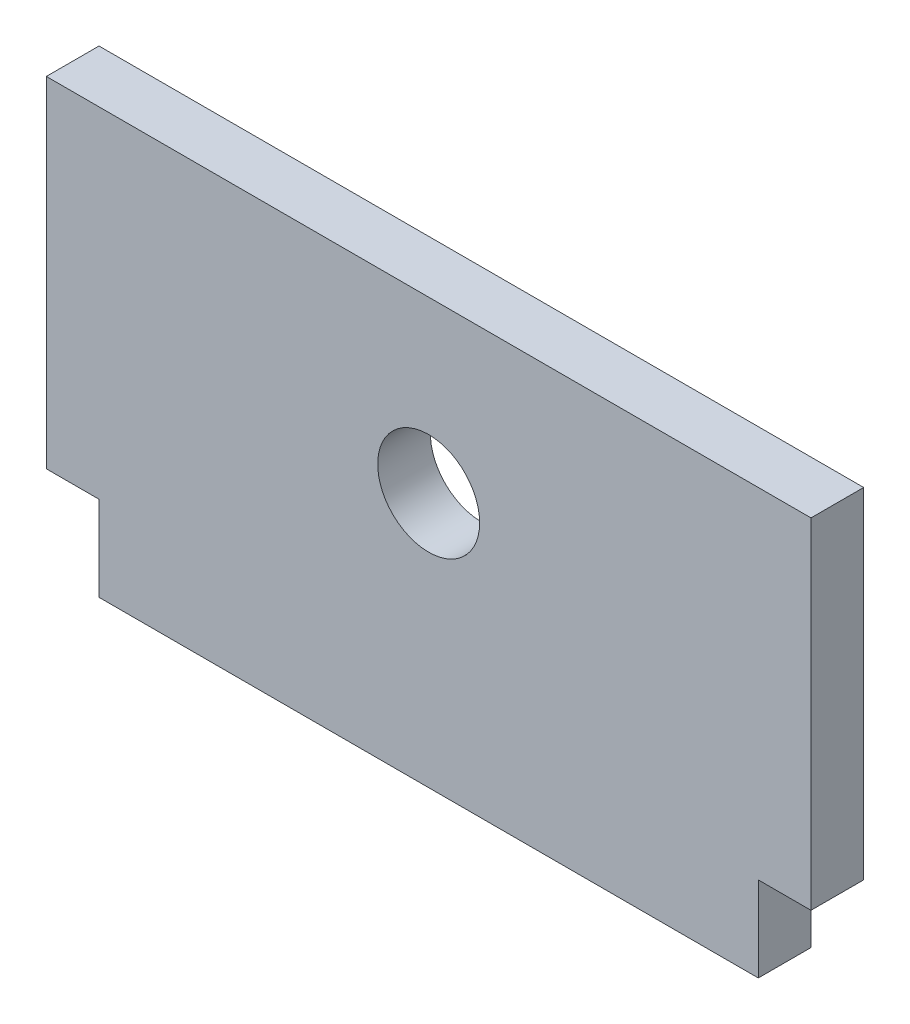
ISO-10303-21;
HEADER;
FILE_DESCRIPTION(('STEP AP214'),'2;1');
FILE_NAME('part.step','',(''),(''),'','','');
FILE_SCHEMA(('AUTOMOTIVE_DESIGN { 1 0 10303 214 1 1 1 1 }'));
ENDSEC;
DATA;
#1=APPLICATION_CONTEXT('core data for automotive mechanical design processes');
#2=APPLICATION_PROTOCOL_DEFINITION('international standard','automotive_design',2000,#1);
#3=PRODUCT_CONTEXT('',#1,'mechanical');
#4=PRODUCT('Part','Part','',(#3));
#5=PRODUCT_RELATED_PRODUCT_CATEGORY('part','',(#4));
#6=PRODUCT_DEFINITION_FORMATION('','',#4);
#7=PRODUCT_DEFINITION_CONTEXT('part definition',#1,'design');
#8=PRODUCT_DEFINITION('design','',#6,#7);
#9=PRODUCT_DEFINITION_SHAPE('','',#8);
#10=(LENGTH_UNIT() NAMED_UNIT(*) SI_UNIT(.MILLI.,.METRE.));
#11=(NAMED_UNIT(*) PLANE_ANGLE_UNIT() SI_UNIT($,.RADIAN.));
#12=(NAMED_UNIT(*) SI_UNIT($,.STERADIAN.) SOLID_ANGLE_UNIT());
#13=UNCERTAINTY_MEASURE_WITH_UNIT(LENGTH_MEASURE(1.E-05),#10,'distance_accuracy_value','');
#14=(GEOMETRIC_REPRESENTATION_CONTEXT(3) GLOBAL_UNCERTAINTY_ASSIGNED_CONTEXT((#13)) GLOBAL_UNIT_ASSIGNED_CONTEXT((#10,
#11,#12)) REPRESENTATION_CONTEXT('',''));
#15=CARTESIAN_POINT('',(0.,0.,0.));
#16=DIRECTION('',(0.,0.,1.));
#17=DIRECTION('',(1.,0.,0.));
#18=AXIS2_PLACEMENT_3D('',#15,#16,#17);
#19=CARTESIAN_POINT('',(-22.5,-10.,3.1));
#20=DIRECTION('',(0.,1.,0.));
#21=DIRECTION('',(0.,0.,1.));
#22=AXIS2_PLACEMENT_3D('',#19,#20,#21);
#23=PLANE('',#22);
#24=DIRECTION('',(0.,0.,1.));
#25=VECTOR('',#24,1.);
#26=CARTESIAN_POINT('',(19.4,-10.,0.));
#27=LINE('',#26,#25);
#28=CARTESIAN_POINT('',(19.4,-10.,0.));
#29=VERTEX_POINT('',#28);
#30=CARTESIAN_POINT('',(19.4,-10.,3.1));
#31=VERTEX_POINT('',#30);
#32=EDGE_CURVE('E139',#29,#31,#27,.T.);
#33=ORIENTED_EDGE('',*,*,#32,.F.);
#34=DIRECTION('',(1.,0.,0.));
#35=VECTOR('',#34,1.);
#36=CARTESIAN_POINT('',(-22.5,-10.,0.));
#37=LINE('',#36,#35);
#38=CARTESIAN_POINT('',(22.5,-10.,0.));
#39=VERTEX_POINT('',#38);
#40=EDGE_CURVE('E80',#29,#39,#37,.T.);
#41=ORIENTED_EDGE('',*,*,#40,.T.);
#42=DIRECTION('',(0.,0.,-1.));
#43=VECTOR('',#42,1.);
#44=CARTESIAN_POINT('',(22.5,-10.,3.1));
#45=LINE('',#44,#43);
#46=CARTESIAN_POINT('',(22.5,-10.,3.1));
#47=VERTEX_POINT('',#46);
#48=EDGE_CURVE('E171',#47,#39,#45,.T.);
#49=ORIENTED_EDGE('',*,*,#48,.F.);
#50=DIRECTION('',(1.,0.,0.));
#51=VECTOR('',#50,1.);
#52=CARTESIAN_POINT('',(-22.5,-10.,3.1));
#53=LINE('',#52,#51);
#54=EDGE_CURVE('E58',#31,#47,#53,.T.);
#55=ORIENTED_EDGE('',*,*,#54,.F.);
#56=EDGE_LOOP('',(#33,#41,#49,#55));
#57=FACE_BOUND('',#56,.T.);
#58=ADVANCED_FACE('F32',(#57),#23,.F.);
#59=CARTESIAN_POINT('',(0.,0.,3.1));
#60=DIRECTION('',(0.,0.,-1.));
#61=DIRECTION('',(-1.,0.,0.));
#62=AXIS2_PLACEMENT_3D('',#59,#60,#61);
#63=PLANE('',#62);
#64=DIRECTION('',(0.,1.,0.));
#65=VECTOR('',#64,1.);
#66=CARTESIAN_POINT('',(22.5,-10.,3.1));
#67=LINE('',#66,#65);
#68=CARTESIAN_POINT('',(22.5,10.,3.1));
#69=VERTEX_POINT('',#68);
#70=EDGE_CURVE('E155',#47,#69,#67,.T.);
#71=ORIENTED_EDGE('',*,*,#70,.T.);
#72=DIRECTION('',(-1.,0.,0.));
#73=VECTOR('',#72,1.);
#74=CARTESIAN_POINT('',(-22.5,10.,3.1));
#75=LINE('',#74,#73);
#76=CARTESIAN_POINT('',(-22.5,10.,3.1));
#77=VERTEX_POINT('',#76);
#78=EDGE_CURVE('E87',#69,#77,#75,.T.);
#79=ORIENTED_EDGE('',*,*,#78,.T.);
#80=DIRECTION('',(0.,-1.,0.));
#81=VECTOR('',#80,1.);
#82=CARTESIAN_POINT('',(-22.5,-10.,3.1));
#83=LINE('',#82,#81);
#84=CARTESIAN_POINT('',(-22.5,-10.,3.1));
#85=VERTEX_POINT('',#84);
#86=EDGE_CURVE('E159',#77,#85,#83,.T.);
#87=ORIENTED_EDGE('',*,*,#86,.T.);
#88=CARTESIAN_POINT('',(-19.4,-10.,3.1));
#89=VERTEX_POINT('',#88);
#90=EDGE_CURVE('E168',#85,#89,#53,.T.);
#91=ORIENTED_EDGE('',*,*,#90,.T.);
#92=DIRECTION('',(0.,-1.,0.));
#93=VECTOR('',#92,1.);
#94=CARTESIAN_POINT('',(-19.4,-10.,3.1));
#95=LINE('',#94,#93);
#96=CARTESIAN_POINT('',(-19.4,-15.,3.1));
#97=VERTEX_POINT('',#96);
#98=EDGE_CURVE('E49',#89,#97,#95,.T.);
#99=ORIENTED_EDGE('',*,*,#98,.T.);
#100=DIRECTION('',(1.,0.,0.));
#101=VECTOR('',#100,1.);
#102=CARTESIAN_POINT('',(-19.4,-15.,3.1));
#103=LINE('',#102,#101);
#104=CARTESIAN_POINT('',(19.4,-15.,3.1));
#105=VERTEX_POINT('',#104);
#106=EDGE_CURVE('E114',#97,#105,#103,.T.);
#107=ORIENTED_EDGE('',*,*,#106,.T.);
#108=DIRECTION('',(0.,1.,0.));
#109=VECTOR('',#108,1.);
#110=CARTESIAN_POINT('',(19.4,-10.,3.1));
#111=LINE('',#110,#109);
#112=EDGE_CURVE('E131',#105,#31,#111,.T.);
#113=ORIENTED_EDGE('',*,*,#112,.T.);
#114=ORIENTED_EDGE('',*,*,#54,.T.);
#115=EDGE_LOOP('',(#71,#79,#87,#91,#99,#107,#113,#114));
#116=FACE_BOUND('',#115,.T.);
#117=CARTESIAN_POINT('',(0.,0.,3.1));
#118=DIRECTION('',(0.,0.,1.));
#119=DIRECTION('',(1.,0.,0.));
#120=AXIS2_PLACEMENT_3D('',#117,#118,#119);
#121=CIRCLE('',#120,3.);
#122=CARTESIAN_POINT('',(3.00000000000001,0.,3.1));
#123=VERTEX_POINT('',#122);
#124=EDGE_CURVE('E148',#123,#123,#121,.T.);
#125=ORIENTED_EDGE('',*,*,#124,.F.);
#126=EDGE_LOOP('',(#125));
#127=FACE_BOUND('',#126,.T.);
#128=ADVANCED_FACE('F197',(#116,#127),#63,.F.);
#129=CARTESIAN_POINT('',(0.,0.,0.));
#130=DIRECTION('',(0.,0.,-1.));
#131=DIRECTION('',(-1.,0.,0.));
#132=AXIS2_PLACEMENT_3D('',#129,#130,#131);
#133=PLANE('',#132);
#134=DIRECTION('',(0.,1.,0.));
#135=VECTOR('',#134,1.);
#136=CARTESIAN_POINT('',(22.5,-10.,0.));
#137=LINE('',#136,#135);
#138=CARTESIAN_POINT('',(22.5,10.,0.));
#139=VERTEX_POINT('',#138);
#140=EDGE_CURVE('E151',#39,#139,#137,.T.);
#141=ORIENTED_EDGE('',*,*,#140,.F.);
#142=ORIENTED_EDGE('',*,*,#40,.F.);
#143=DIRECTION('',(0.,1.,0.));
#144=VECTOR('',#143,1.);
#145=CARTESIAN_POINT('',(19.4,-10.,0.));
#146=LINE('',#145,#144);
#147=CARTESIAN_POINT('',(19.4,-15.,0.));
#148=VERTEX_POINT('',#147);
#149=EDGE_CURVE('E117',#148,#29,#146,.T.);
#150=ORIENTED_EDGE('',*,*,#149,.F.);
#151=DIRECTION('',(1.,0.,0.));
#152=VECTOR('',#151,1.);
#153=CARTESIAN_POINT('',(-19.4,-15.,0.));
#154=LINE('',#153,#152);
#155=CARTESIAN_POINT('',(-19.4,-15.,0.));
#156=VERTEX_POINT('',#155);
#157=EDGE_CURVE('E112',#156,#148,#154,.T.);
#158=ORIENTED_EDGE('',*,*,#157,.F.);
#159=DIRECTION('',(0.,-1.,0.));
#160=VECTOR('',#159,1.);
#161=CARTESIAN_POINT('',(-19.4,-10.,0.));
#162=LINE('',#161,#160);
#163=CARTESIAN_POINT('',(-19.4,-10.,0.));
#164=VERTEX_POINT('',#163);
#165=EDGE_CURVE('E126',#164,#156,#162,.T.);
#166=ORIENTED_EDGE('',*,*,#165,.F.);
#167=CARTESIAN_POINT('',(-22.5,-10.,0.));
#168=VERTEX_POINT('',#167);
#169=EDGE_CURVE('E157',#168,#164,#37,.T.);
#170=ORIENTED_EDGE('',*,*,#169,.F.);
#171=DIRECTION('',(0.,-1.,0.));
#172=VECTOR('',#171,1.);
#173=CARTESIAN_POINT('',(-22.5,-10.,0.));
#174=LINE('',#173,#172);
#175=CARTESIAN_POINT('',(-22.5,10.,0.));
#176=VERTEX_POINT('',#175);
#177=EDGE_CURVE('E174',#176,#168,#174,.T.);
#178=ORIENTED_EDGE('',*,*,#177,.F.);
#179=DIRECTION('',(-1.,0.,0.));
#180=VECTOR('',#179,1.);
#181=CARTESIAN_POINT('',(-22.5,10.,0.));
#182=LINE('',#181,#180);
#183=EDGE_CURVE('E189',#139,#176,#182,.T.);
#184=ORIENTED_EDGE('',*,*,#183,.F.);
#185=EDGE_LOOP('',(#141,#142,#150,#158,#166,#170,#178,#184));
#186=FACE_BOUND('',#185,.T.);
#187=CARTESIAN_POINT('',(0.,0.,0.));
#188=DIRECTION('',(0.,0.,1.));
#189=DIRECTION('',(1.,0.,0.));
#190=AXIS2_PLACEMENT_3D('',#187,#188,#189);
#191=CIRCLE('',#190,3.);
#192=CARTESIAN_POINT('',(3.00000000000001,0.,0.));
#193=VERTEX_POINT('',#192);
#194=EDGE_CURVE('E152',#193,#193,#191,.T.);
#195=ORIENTED_EDGE('',*,*,#194,.T.);
#196=EDGE_LOOP('',(#195));
#197=FACE_BOUND('',#196,.T.);
#198=ADVANCED_FACE('F123',(#186,#197),#133,.T.);
#199=CARTESIAN_POINT('',(22.5,-10.,3.1));
#200=DIRECTION('',(-1.,0.,0.));
#201=DIRECTION('',(0.,0.,1.));
#202=AXIS2_PLACEMENT_3D('',#199,#200,#201);
#203=PLANE('',#202);
#204=ORIENTED_EDGE('',*,*,#140,.T.);
#205=DIRECTION('',(0.,0.,-1.));
#206=VECTOR('',#205,1.);
#207=CARTESIAN_POINT('',(22.5,10.,3.1));
#208=LINE('',#207,#206);
#209=EDGE_CURVE('E11',#69,#139,#208,.T.);
#210=ORIENTED_EDGE('',*,*,#209,.F.);
#211=ORIENTED_EDGE('',*,*,#70,.F.);
#212=ORIENTED_EDGE('',*,*,#48,.T.);
#213=EDGE_LOOP('',(#204,#210,#211,#212));
#214=FACE_BOUND('',#213,.T.);
#215=ADVANCED_FACE('F34',(#214),#203,.F.);
#216=CARTESIAN_POINT('',(-22.5,10.,3.1));
#217=DIRECTION('',(0.,-1.,0.));
#218=DIRECTION('',(0.,0.,-1.));
#219=AXIS2_PLACEMENT_3D('',#216,#217,#218);
#220=PLANE('',#219);
#221=ORIENTED_EDGE('',*,*,#183,.T.);
#222=DIRECTION('',(0.,0.,-1.));
#223=VECTOR('',#222,1.);
#224=CARTESIAN_POINT('',(-22.5,10.,3.1));
#225=LINE('',#224,#223);
#226=EDGE_CURVE('E41',#77,#176,#225,.T.);
#227=ORIENTED_EDGE('',*,*,#226,.F.);
#228=ORIENTED_EDGE('',*,*,#78,.F.);
#229=ORIENTED_EDGE('',*,*,#209,.T.);
#230=EDGE_LOOP('',(#221,#227,#228,#229));
#231=FACE_BOUND('',#230,.T.);
#232=ADVANCED_FACE('F212',(#231),#220,.F.);
#233=CARTESIAN_POINT('',(-22.5,-10.,3.1));
#234=DIRECTION('',(1.,0.,0.));
#235=DIRECTION('',(0.,0.,-1.));
#236=AXIS2_PLACEMENT_3D('',#233,#234,#235);
#237=PLANE('',#236);
#238=ORIENTED_EDGE('',*,*,#177,.T.);
#239=DIRECTION('',(0.,0.,-1.));
#240=VECTOR('',#239,1.);
#241=CARTESIAN_POINT('',(-22.5,-10.,3.1));
#242=LINE('',#241,#240);
#243=EDGE_CURVE('E180',#85,#168,#242,.T.);
#244=ORIENTED_EDGE('',*,*,#243,.F.);
#245=ORIENTED_EDGE('',*,*,#86,.F.);
#246=ORIENTED_EDGE('',*,*,#226,.T.);
#247=EDGE_LOOP('',(#238,#244,#245,#246));
#248=FACE_BOUND('',#247,.T.);
#249=ADVANCED_FACE('F187',(#248),#237,.F.);
#250=ORIENTED_EDGE('',*,*,#169,.T.);
#251=DIRECTION('',(0.,0.,1.));
#252=VECTOR('',#251,1.);
#253=CARTESIAN_POINT('',(-19.4,-10.,0.));
#254=LINE('',#253,#252);
#255=EDGE_CURVE('E130',#164,#89,#254,.T.);
#256=ORIENTED_EDGE('',*,*,#255,.T.);
#257=ORIENTED_EDGE('',*,*,#90,.F.);
#258=ORIENTED_EDGE('',*,*,#243,.T.);
#259=EDGE_LOOP('',(#250,#256,#257,#258));
#260=FACE_BOUND('',#259,.T.);
#261=ADVANCED_FACE('F202',(#260),#23,.F.);
#262=CARTESIAN_POINT('',(0.,0.,3.1));
#263=DIRECTION('',(0.,0.,-1.));
#264=DIRECTION('',(-1.,0.,0.));
#265=AXIS2_PLACEMENT_3D('',#262,#263,#264);
#266=CYLINDRICAL_SURFACE('',#265,3.);
#267=ORIENTED_EDGE('',*,*,#124,.T.);
#268=EDGE_LOOP('',(#267));
#269=FACE_BOUND('',#268,.T.);
#270=ORIENTED_EDGE('',*,*,#194,.F.);
#271=EDGE_LOOP('',(#270));
#272=FACE_BOUND('',#271,.T.);
#273=ADVANCED_FACE('F204',(#269,#272),#266,.F.);
#274=CARTESIAN_POINT('',(-19.4,-10.,0.));
#275=DIRECTION('',(-1.,0.,0.));
#276=DIRECTION('',(0.,0.,1.));
#277=AXIS2_PLACEMENT_3D('',#274,#275,#276);
#278=PLANE('',#277);
#279=ORIENTED_EDGE('',*,*,#98,.F.);
#280=ORIENTED_EDGE('',*,*,#255,.F.);
#281=ORIENTED_EDGE('',*,*,#165,.T.);
#282=DIRECTION('',(0.,0.,1.));
#283=VECTOR('',#282,1.);
#284=CARTESIAN_POINT('',(-19.4,-15.,0.));
#285=LINE('',#284,#283);
#286=EDGE_CURVE('E109',#156,#97,#285,.T.);
#287=ORIENTED_EDGE('',*,*,#286,.T.);
#288=EDGE_LOOP('',(#279,#280,#281,#287));
#289=FACE_BOUND('',#288,.T.);
#290=ADVANCED_FACE('F129',(#289),#278,.T.);
#291=CARTESIAN_POINT('',(19.4,-10.,0.));
#292=DIRECTION('',(1.,0.,0.));
#293=DIRECTION('',(0.,1.,0.));
#294=AXIS2_PLACEMENT_3D('',#291,#292,#293);
#295=PLANE('',#294);
#296=ORIENTED_EDGE('',*,*,#112,.F.);
#297=DIRECTION('',(0.,0.,1.));
#298=VECTOR('',#297,1.);
#299=CARTESIAN_POINT('',(19.4,-15.,0.));
#300=LINE('',#299,#298);
#301=EDGE_CURVE('E116',#148,#105,#300,.T.);
#302=ORIENTED_EDGE('',*,*,#301,.F.);
#303=ORIENTED_EDGE('',*,*,#149,.T.);
#304=ORIENTED_EDGE('',*,*,#32,.T.);
#305=EDGE_LOOP('',(#296,#302,#303,#304));
#306=FACE_BOUND('',#305,.T.);
#307=ADVANCED_FACE('F196',(#306),#295,.T.);
#308=CARTESIAN_POINT('',(-19.4,-15.,0.));
#309=DIRECTION('',(0.,-1.,0.));
#310=DIRECTION('',(1.,0.,0.));
#311=AXIS2_PLACEMENT_3D('',#308,#309,#310);
#312=PLANE('',#311);
#313=ORIENTED_EDGE('',*,*,#106,.F.);
#314=ORIENTED_EDGE('',*,*,#286,.F.);
#315=ORIENTED_EDGE('',*,*,#157,.T.);
#316=ORIENTED_EDGE('',*,*,#301,.T.);
#317=EDGE_LOOP('',(#313,#314,#315,#316));
#318=FACE_BOUND('',#317,.T.);
#319=ADVANCED_FACE('F111',(#318),#312,.T.);
#320=CLOSED_SHELL('',(#58,#128,#198,#215,#232,#249,#261,#273,#290,#307,#319));
#321=MANIFOLD_SOLID_BREP('B2',#320);
#322=ADVANCED_BREP_SHAPE_REPRESENTATION('',(#18,#321),#14);
#323=SHAPE_DEFINITION_REPRESENTATION(#9,#322);
ENDSEC;
END-ISO-10303-21;
